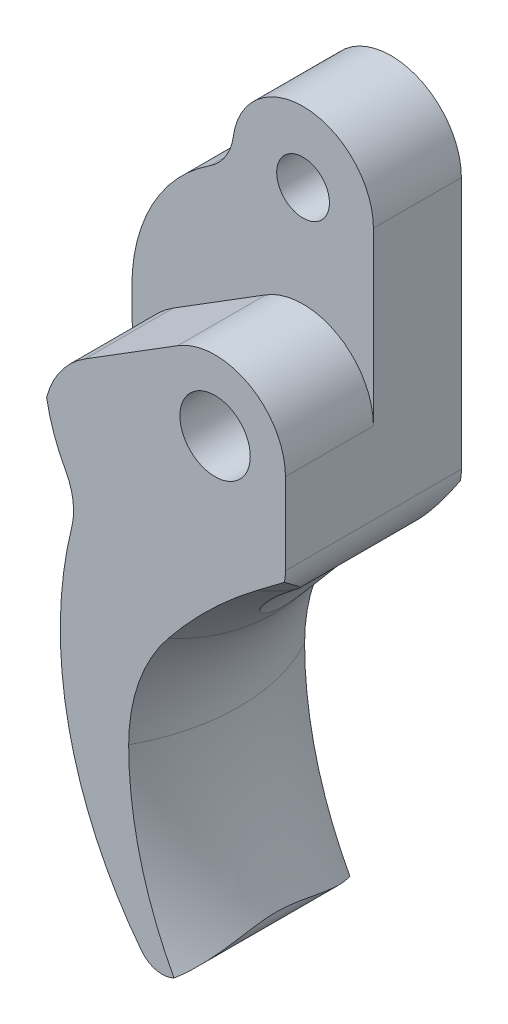
ISO-10303-21;
HEADER;
FILE_DESCRIPTION(('STEP AP214'),'2;1');
FILE_NAME('part.step','',(''),(''),'','','');
FILE_SCHEMA(('AUTOMOTIVE_DESIGN { 1 0 10303 214 1 1 1 1 }'));
ENDSEC;
DATA;
#1=APPLICATION_CONTEXT('core data for automotive mechanical design processes');
#2=APPLICATION_PROTOCOL_DEFINITION('international standard','automotive_design',2000,#1);
#3=PRODUCT_CONTEXT('',#1,'mechanical');
#4=PRODUCT('Part','Part','',(#3));
#5=PRODUCT_RELATED_PRODUCT_CATEGORY('part','',(#4));
#6=PRODUCT_DEFINITION_FORMATION('','',#4);
#7=PRODUCT_DEFINITION_CONTEXT('part definition',#1,'design');
#8=PRODUCT_DEFINITION('design','',#6,#7);
#9=PRODUCT_DEFINITION_SHAPE('','',#8);
#10=(LENGTH_UNIT() NAMED_UNIT(*) SI_UNIT(.MILLI.,.METRE.));
#11=(NAMED_UNIT(*) PLANE_ANGLE_UNIT() SI_UNIT($,.RADIAN.));
#12=(NAMED_UNIT(*) SI_UNIT($,.STERADIAN.) SOLID_ANGLE_UNIT());
#13=UNCERTAINTY_MEASURE_WITH_UNIT(LENGTH_MEASURE(1.E-05),#10,'distance_accuracy_value','');
#14=(GEOMETRIC_REPRESENTATION_CONTEXT(3) GLOBAL_UNCERTAINTY_ASSIGNED_CONTEXT((#13)) GLOBAL_UNIT_ASSIGNED_CONTEXT((#10,
#11,#12)) REPRESENTATION_CONTEXT('',''));
#15=CARTESIAN_POINT('',(0.,0.,0.));
#16=DIRECTION('',(0.,0.,1.));
#17=DIRECTION('',(1.,0.,0.));
#18=AXIS2_PLACEMENT_3D('',#15,#16,#17);
#19=CARTESIAN_POINT('',(37.0468900795997,16.1214230632718,10.));
#20=DIRECTION('',(0.,0.,-1.));
#21=DIRECTION('',(-1.,0.,0.));
#22=AXIS2_PLACEMENT_3D('',#19,#20,#21);
#23=CYLINDRICAL_SURFACE('',#22,1.5);
#24=CARTESIAN_POINT('',(37.0468900795997,16.1214230632718,0.));
#25=DIRECTION('',(0.,0.,1.));
#26=DIRECTION('',(1.,0.,0.));
#27=AXIS2_PLACEMENT_3D('',#24,#25,#26);
#28=CIRCLE('',#27,1.5);
#29=CARTESIAN_POINT('',(37.7113891036625,14.7766401636856,0.));
#30=VERTEX_POINT('',#29);
#31=CARTESIAN_POINT('',(35.8593769816345,15.2050101420617,0.));
#32=VERTEX_POINT('',#31);
#33=EDGE_CURVE('E288',#30,#32,#28,.F.);
#34=ORIENTED_EDGE('',*,*,#33,.F.);
#35=CARTESIAN_POINT('',(37.7112915680597,14.7765919727135,-0.000199999999999497));
#36=CARTESIAN_POINT('',(37.7536660796321,14.7975449268555,0.0866944281838508));
#37=CARTESIAN_POINT('',(37.7938881450415,14.8198894363823,0.174271305247938));
#38=CARTESIAN_POINT('',(37.870232348617,14.8667815741816,0.350563302515582));
#39=CARTESIAN_POINT('',(37.9063565368767,14.8913280897247,0.439277828627219));
#40=CARTESIAN_POINT('',(37.974677887401,14.9420114038807,0.617512596830948));
#41=CARTESIAN_POINT('',(38.0068834001479,14.9681446364688,0.707030673105937));
#42=CARTESIAN_POINT('',(38.067681275715,15.0215941470922,0.886943528837865));
#43=CARTESIAN_POINT('',(38.0962731347963,15.0489105893545,0.977338428635997));
#44=CARTESIAN_POINT('',(38.1774910137822,15.1325703397987,1.25151425201171));
#45=CARTESIAN_POINT('',(38.2248835280636,15.1900999507036,1.43649840473062));
#46=CARTESIAN_POINT('',(38.3074832707277,15.3053780990301,1.80914993243926));
#47=CARTESIAN_POINT('',(38.3426836528483,15.3631267411058,1.996818753568));
#48=CARTESIAN_POINT('',(38.4070775822015,15.4847792338819,2.40358988779562));
#49=CARTESIAN_POINT('',(38.4345192468538,15.5482669229304,2.62309466755423));
#50=CARTESIAN_POINT('',(38.4778654840021,15.6672193579066,3.06550163311419));
#51=CARTESIAN_POINT('',(38.4937644320608,15.7226801820476,3.28840542121775));
#52=CARTESIAN_POINT('',(38.5168472465537,15.8186720737926,3.73525842315989));
#53=CARTESIAN_POINT('',(38.5241319275385,15.859371901039,3.95916411979586));
#54=CARTESIAN_POINT('',(38.5311514432042,15.9041752813241,4.29709914363822));
#55=CARTESIAN_POINT('',(38.5328402047293,15.9163992543672,4.41001393368922));
#56=CARTESIAN_POINT('',(38.5352440428286,15.9346367144495,4.63635990998935));
#57=CARTESIAN_POINT('',(38.5359591972535,15.9406506980363,4.74979105422246));
#58=CARTESIAN_POINT('',(38.5366032576177,15.9460268231242,4.97809129981084));
#59=CARTESIAN_POINT('',(38.5365232516444,15.9453135723863,5.09296225513823));
#60=CARTESIAN_POINT('',(38.5355291362371,15.9371237149577,5.32245450143362));
#61=CARTESIAN_POINT('',(38.5346149818389,15.9296467436734,5.43707577860901));
#62=CARTESIAN_POINT('',(38.5302978023068,15.8978598759886,5.78033131507188));
#63=CARTESIAN_POINT('',(38.5253185340191,15.8641897089152,6.00808946499086));
#64=CARTESIAN_POINT('',(38.5079385898666,15.7790948795662,6.46268607386478));
#65=CARTESIAN_POINT('',(38.4954461790898,15.7274541373677,6.68947768001356));
#66=CARTESIAN_POINT('',(38.4596703918999,15.6138633254265,7.13953176823015));
#67=CARTESIAN_POINT('',(38.4363889314774,15.5519150874083,7.36279486963621));
#68=CARTESIAN_POINT('',(38.3779217213972,15.4265230078404,7.79394465277349));
#69=CARTESIAN_POINT('',(38.3434539320103,15.3633446925721,8.0020061867956));
#70=CARTESIAN_POINT('',(38.2602624265405,15.2362667394388,8.41493899348692));
#71=CARTESIAN_POINT('',(38.2115497240276,15.1723676953701,8.6198126025206));
#72=CARTESIAN_POINT('',(38.1265137207748,15.0792401393718,8.92297943427166));
#73=CARTESIAN_POINT('',(38.0964183710011,15.0488489459133,9.02267962832192));
#74=CARTESIAN_POINT('',(38.0319374988948,14.9893426320892,9.22105761941984));
#75=CARTESIAN_POINT('',(37.9975527254894,14.9602272901579,9.31973559169651));
#76=CARTESIAN_POINT('',(37.9241005852908,14.9037788287653,9.51619039133998));
#77=CARTESIAN_POINT('',(37.8850208227809,14.876450735013,9.61396406517536));
#78=CARTESIAN_POINT('',(37.8019285389153,14.8243859750154,9.80816623940301));
#79=CARTESIAN_POINT('',(37.7579129147288,14.7996509579714,9.90459385031087));
#80=CARTESIAN_POINT('',(37.7112915680597,14.7765919727135,10.0002));
#81=B_SPLINE_CURVE_WITH_KNOTS('',3,(#35,#36,#37,#38,#39,#40,#41,#42,#43,#44,#45,#46,#47,#48,#49,
#50,#51,#52,#53,#54,#55,#56,#57,#58,#59,#60,#61,#62,#63,#64,#65,#66,#67,#68,#69,#70,#71,#72,#73,
#74,#75,#76,#77,#78,#79,#80),.UNSPECIFIED.,.F.,.F.,(4,2,2,2,2,2,2,2,2,2,2,2,2,2,2,2,2,2,2,2,2,2,
4),(0.,0.29668562632712,0.593222165457578,0.889115303579091,1.18504964345908,1.78284891382982,
2.38098332496234,3.07094677921029,3.76124620777969,4.4433843463613,4.78399759100309,
5.12458359827429,5.46899105482292,5.81341707751812,6.50306778889993,7.20131506504774,
7.89943838933107,8.55951279604266,9.21907820412387,9.54446102473464,9.86978711328128,
10.1959918267588,10.522402764171),.UNSPECIFIED.);
#82=CARTESIAN_POINT('',(37.7113891036625,14.7766401636856,10.));
#83=VERTEX_POINT('',#82);
#84=EDGE_CURVE('E178',#30,#83,#81,.T.);
#85=ORIENTED_EDGE('',*,*,#84,.T.);
#86=CARTESIAN_POINT('',(37.0468900795997,16.1214230632718,10.));
#87=DIRECTION('',(0.,0.,1.));
#88=DIRECTION('',(1.,0.,0.));
#89=AXIS2_PLACEMENT_3D('',#86,#87,#88);
#90=CIRCLE('',#89,1.5);
#91=CARTESIAN_POINT('',(35.8593769816345,15.2050101420617,10.));
#92=VERTEX_POINT('',#91);
#93=EDGE_CURVE('E287',#83,#92,#90,.F.);
#94=ORIENTED_EDGE('',*,*,#93,.T.);
#95=DIRECTION('',(0.,0.,-1.));
#96=VECTOR('',#95,1.);
#97=CARTESIAN_POINT('',(35.8593769816345,15.2050101420617,10.));
#98=LINE('',#97,#96);
#99=EDGE_CURVE('E284',#92,#32,#98,.T.);
#100=ORIENTED_EDGE('',*,*,#99,.T.);
#101=EDGE_LOOP('',(#34,#85,#94,#100));
#102=FACE_BOUND('',#101,.T.);
#103=ADVANCED_FACE('F36',(#102),#23,.T.);
#104=CARTESIAN_POINT('',(44.0468900795998,52.3520772627957,10.));
#105=DIRECTION('',(-1.,0.,0.));
#106=DIRECTION('',(0.,0.,1.));
#107=AXIS2_PLACEMENT_3D('',#104,#105,#106);
#108=PLANE('',#107);
#109=DIRECTION('',(0.,1.,0.));
#110=VECTOR('',#109,1.);
#111=CARTESIAN_POINT('',(44.0468900795998,52.3520772627957,10.));
#112=LINE('',#111,#110);
#113=CARTESIAN_POINT('',(44.0468900795998,37.9918684263362,10.));
#114=VERTEX_POINT('',#113);
#115=CARTESIAN_POINT('',(44.0468900795998,42.6214230632718,10.));
#116=VERTEX_POINT('',#115);
#117=EDGE_CURVE('E325',#114,#116,#112,.T.);
#118=ORIENTED_EDGE('',*,*,#117,.F.);
#119=DIRECTION('',(0.,0.,1.));
#120=VECTOR('',#119,1.);
#121=CARTESIAN_POINT('',(44.0468900795998,37.9918684263362,0.));
#122=LINE('',#121,#120);
#123=CARTESIAN_POINT('',(44.0468900795998,37.9918684263362,0.));
#124=VERTEX_POINT('',#123);
#125=EDGE_CURVE('E253',#114,#124,#122,.F.);
#126=ORIENTED_EDGE('',*,*,#125,.T.);
#127=DIRECTION('',(0.,1.,0.));
#128=VECTOR('',#127,1.);
#129=CARTESIAN_POINT('',(44.0468900795998,52.3520772627957,0.));
#130=LINE('',#129,#128);
#131=CARTESIAN_POINT('',(44.0468900795998,52.3520772627957,0.));
#132=VERTEX_POINT('',#131);
#133=EDGE_CURVE('E326',#124,#132,#130,.T.);
#134=ORIENTED_EDGE('',*,*,#133,.T.);
#135=DIRECTION('',(0.,0.,1.));
#136=VECTOR('',#135,1.);
#137=CARTESIAN_POINT('',(44.0468900795998,52.3520772627957,0.));
#138=LINE('',#137,#136);
#139=CARTESIAN_POINT('',(44.0468900795998,52.3520772627957,5.));
#140=VERTEX_POINT('',#139);
#141=EDGE_CURVE('E328',#132,#140,#138,.T.);
#142=ORIENTED_EDGE('',*,*,#141,.T.);
#143=DIRECTION('',(0.,-1.,0.));
#144=VECTOR('',#143,1.);
#145=CARTESIAN_POINT('',(44.0468900795998,-12.4832278226516,5.));
#146=LINE('',#145,#144);
#147=CARTESIAN_POINT('',(44.0468900795998,42.6214230632718,5.));
#148=VERTEX_POINT('',#147);
#149=EDGE_CURVE('E323',#140,#148,#146,.T.);
#150=ORIENTED_EDGE('',*,*,#149,.T.);
#151=DIRECTION('',(0.,0.,1.));
#152=VECTOR('',#151,1.);
#153=CARTESIAN_POINT('',(44.0468900795998,42.6214230632718,5.));
#154=LINE('',#153,#152);
#155=EDGE_CURVE('E332',#148,#116,#154,.T.);
#156=ORIENTED_EDGE('',*,*,#155,.T.);
#157=EDGE_LOOP('',(#118,#126,#134,#142,#150,#156));
#158=FACE_BOUND('',#157,.T.);
#159=ADVANCED_FACE('F384',(#158),#108,.F.);
#160=CARTESIAN_POINT('',(40.0468900795998,52.3520772627957,10.));
#161=DIRECTION('',(0.,0.,-1.));
#162=DIRECTION('',(-1.,0.,0.));
#163=AXIS2_PLACEMENT_3D('',#160,#161,#162);
#164=CYLINDRICAL_SURFACE('',#163,4.);
#165=CARTESIAN_POINT('',(40.0468900795998,52.3520772627957,0.));
#166=DIRECTION('',(0.,0.,1.));
#167=DIRECTION('',(1.,0.,0.));
#168=AXIS2_PLACEMENT_3D('',#165,#166,#167);
#169=CIRCLE('',#168,4.);
#170=CARTESIAN_POINT('',(36.0834796424937,52.8918713967383,0.));
#171=VERTEX_POINT('',#170);
#172=EDGE_CURVE('E302',#132,#171,#169,.T.);
#173=ORIENTED_EDGE('',*,*,#172,.T.);
#174=DIRECTION('',(0.,0.,-1.));
#175=VECTOR('',#174,1.);
#176=CARTESIAN_POINT('',(36.0834796424937,52.8918713967383,10.));
#177=LINE('',#176,#175);
#178=CARTESIAN_POINT('',(36.0834796424937,52.8918713967383,5.));
#179=VERTEX_POINT('',#178);
#180=EDGE_CURVE('E276',#171,#179,#177,.F.);
#181=ORIENTED_EDGE('',*,*,#180,.T.);
#182=CARTESIAN_POINT('',(40.0468900795998,52.3520772627957,5.));
#183=DIRECTION('',(0.,0.,1.));
#184=DIRECTION('',(1.,0.,0.));
#185=AXIS2_PLACEMENT_3D('',#182,#183,#184);
#186=CIRCLE('',#185,4.);
#187=EDGE_CURVE('E320',#140,#179,#186,.T.);
#188=ORIENTED_EDGE('',*,*,#187,.F.);
#189=ORIENTED_EDGE('',*,*,#141,.F.);
#190=EDGE_LOOP('',(#173,#181,#188,#189));
#191=FACE_BOUND('',#190,.T.);
#192=ADVANCED_FACE('F389',(#191),#164,.T.);
#193=CARTESIAN_POINT('',(40.0468900795998,42.6214230632718,10.));
#194=DIRECTION('',(0.,0.,-1.));
#195=DIRECTION('',(-1.,0.,0.));
#196=AXIS2_PLACEMENT_3D('',#193,#194,#195);
#197=CYLINDRICAL_SURFACE('',#196,9.73065419952389);
#198=CARTESIAN_POINT('',(40.0468900795998,42.6214230632718,5.));
#199=DIRECTION('',(0.,0.,1.));
#200=DIRECTION('',(1.,0.,0.));
#201=AXIS2_PLACEMENT_3D('',#198,#199,#200);
#202=CIRCLE('',#201,9.73065419952389);
#203=CARTESIAN_POINT('',(34.7453943616905,50.7810660887786,5.));
#204=VERTEX_POINT('',#203);
#205=CARTESIAN_POINT('',(30.3162358800759,42.6214230632718,5.));
#206=VERTEX_POINT('',#205);
#207=EDGE_CURVE('E308',#204,#206,#202,.T.);
#208=ORIENTED_EDGE('',*,*,#207,.F.);
#209=DIRECTION('',(0.,0.,-1.));
#210=VECTOR('',#209,1.);
#211=CARTESIAN_POINT('',(34.7453943616905,50.7810660887786,10.));
#212=LINE('',#211,#210);
#213=CARTESIAN_POINT('',(34.7453943616905,50.7810660887786,0.));
#214=VERTEX_POINT('',#213);
#215=EDGE_CURVE('E271',#204,#214,#212,.T.);
#216=ORIENTED_EDGE('',*,*,#215,.T.);
#217=CARTESIAN_POINT('',(40.0468900795998,42.6214230632718,0.));
#218=DIRECTION('',(0.,0.,1.));
#219=DIRECTION('',(1.,0.,0.));
#220=AXIS2_PLACEMENT_3D('',#217,#218,#219);
#221=CIRCLE('',#220,9.73065419952389);
#222=CARTESIAN_POINT('',(30.3162358800759,42.6214230632718,0.));
#223=VERTEX_POINT('',#222);
#224=EDGE_CURVE('E299',#214,#223,#221,.T.);
#225=ORIENTED_EDGE('',*,*,#224,.T.);
#226=DIRECTION('',(0.,0.,-1.));
#227=VECTOR('',#226,1.);
#228=CARTESIAN_POINT('',(30.3162358800759,42.6214230632718,10.));
#229=LINE('',#228,#227);
#230=EDGE_CURVE('E272',#206,#223,#229,.T.);
#231=ORIENTED_EDGE('',*,*,#230,.F.);
#232=EDGE_LOOP('',(#208,#216,#225,#231));
#233=FACE_BOUND('',#232,.T.);
#234=ADVANCED_FACE('F405',(#233),#197,.T.);
#235=CARTESIAN_POINT('',(30.3162358800759,0.,10.));
#236=DIRECTION('',(-1.,0.,0.));
#237=DIRECTION('',(0.,0.,1.));
#238=AXIS2_PLACEMENT_3D('',#235,#236,#237);
#239=PLANE('',#238);
#240=DIRECTION('',(0.,1.,0.));
#241=VECTOR('',#240,1.);
#242=CARTESIAN_POINT('',(30.3162358800759,0.,0.));
#243=LINE('',#242,#241);
#244=CARTESIAN_POINT('',(30.3162358800759,41.485061410367,0.));
#245=VERTEX_POINT('',#244);
#246=EDGE_CURVE('E297',#245,#223,#243,.T.);
#247=ORIENTED_EDGE('',*,*,#246,.F.);
#248=DIRECTION('',(0.,0.,-1.));
#249=VECTOR('',#248,1.);
#250=CARTESIAN_POINT('',(30.3162358800759,41.485061410367,10.));
#251=LINE('',#250,#249);
#252=CARTESIAN_POINT('',(30.3162358800759,41.485061410367,5.));
#253=VERTEX_POINT('',#252);
#254=EDGE_CURVE('E261',#245,#253,#251,.F.);
#255=ORIENTED_EDGE('',*,*,#254,.T.);
#256=DIRECTION('',(0.,1.,0.));
#257=VECTOR('',#256,1.);
#258=CARTESIAN_POINT('',(30.3162358800759,0.,5.));
#259=LINE('',#258,#257);
#260=EDGE_CURVE('E269',#253,#206,#259,.T.);
#261=ORIENTED_EDGE('',*,*,#260,.T.);
#262=ORIENTED_EDGE('',*,*,#230,.T.);
#263=EDGE_LOOP('',(#247,#255,#261,#262));
#264=FACE_BOUND('',#263,.T.);
#265=ADVANCED_FACE('F401',(#264),#239,.T.);
#266=CARTESIAN_POINT('',(28.4089876840903,34.9229552352527,10.));
#267=DIRECTION('',(0.,0.,-1.));
#268=DIRECTION('',(-1.,0.,0.));
#269=AXIS2_PLACEMENT_3D('',#266,#267,#268);
#270=CYLINDRICAL_SURFACE('',#269,3.59572716165903);
#271=CARTESIAN_POINT('',(28.4089876840903,34.9229552352527,10.));
#272=DIRECTION('',(0.,0.,1.));
#273=DIRECTION('',(1.,0.,0.));
#274=AXIS2_PLACEMENT_3D('',#271,#272,#273);
#275=CIRCLE('',#274,3.59572716165903);
#276=CARTESIAN_POINT('',(31.8989691004052,34.0573435816405,10.));
#277=VERTEX_POINT('',#276);
#278=CARTESIAN_POINT('',(31.5581547164844,36.6584669244024,10.));
#279=VERTEX_POINT('',#278);
#280=EDGE_CURVE('E313',#277,#279,#275,.T.);
#281=ORIENTED_EDGE('',*,*,#280,.T.);
#282=DIRECTION('',(0.,0.,-1.));
#283=VECTOR('',#282,1.);
#284=CARTESIAN_POINT('',(31.5581547164844,36.6584669244024,10.));
#285=LINE('',#284,#283);
#286=CARTESIAN_POINT('',(31.5581547164844,36.6584669244024,0.));
#287=VERTEX_POINT('',#286);
#288=EDGE_CURVE('E265',#279,#287,#285,.T.);
#289=ORIENTED_EDGE('',*,*,#288,.T.);
#290=CARTESIAN_POINT('',(28.4089876840903,34.9229552352527,0.));
#291=DIRECTION('',(0.,0.,1.));
#292=DIRECTION('',(1.,0.,0.));
#293=AXIS2_PLACEMENT_3D('',#290,#291,#292);
#294=CIRCLE('',#293,3.59572716165903);
#295=CARTESIAN_POINT('',(31.8989691004052,34.0573435816405,0.));
#296=VERTEX_POINT('',#295);
#297=EDGE_CURVE('E294',#296,#287,#294,.T.);
#298=ORIENTED_EDGE('',*,*,#297,.F.);
#299=DIRECTION('',(0.,0.,-1.));
#300=VECTOR('',#299,1.);
#301=CARTESIAN_POINT('',(31.8989691004052,34.0573435816405,10.));
#302=LINE('',#301,#300);
#303=EDGE_CURVE('E282',#277,#296,#302,.T.);
#304=ORIENTED_EDGE('',*,*,#303,.F.);
#305=EDGE_LOOP('',(#281,#289,#298,#304));
#306=FACE_BOUND('',#305,.T.);
#307=ADVANCED_FACE('F397',(#306),#270,.F.);
#308=CARTESIAN_POINT('',(53.3835761925783,28.7285684238916,10.));
#309=DIRECTION('',(0.,0.,-1.));
#310=DIRECTION('',(-1.,0.,0.));
#311=AXIS2_PLACEMENT_3D('',#308,#309,#310);
#312=CYLINDRICAL_SURFACE('',#311,22.135586429704);
#313=CARTESIAN_POINT('',(53.3835761925783,28.7285684238916,0.));
#314=DIRECTION('',(0.,0.,1.));
#315=DIRECTION('',(1.,0.,0.));
#316=AXIS2_PLACEMENT_3D('',#313,#314,#315);
#317=CIRCLE('',#316,22.135586429704);
#318=EDGE_CURVE('E291',#32,#296,#317,.F.);
#319=ORIENTED_EDGE('',*,*,#318,.F.);
#320=ORIENTED_EDGE('',*,*,#99,.F.);
#321=CARTESIAN_POINT('',(53.3835761925783,28.7285684238916,10.));
#322=DIRECTION('',(0.,0.,1.));
#323=DIRECTION('',(1.,0.,0.));
#324=AXIS2_PLACEMENT_3D('',#321,#322,#323);
#325=CIRCLE('',#324,22.135586429704);
#326=EDGE_CURVE('E310',#92,#277,#325,.F.);
#327=ORIENTED_EDGE('',*,*,#326,.T.);
#328=ORIENTED_EDGE('',*,*,#303,.T.);
#329=EDGE_LOOP('',(#319,#320,#327,#328));
#330=FACE_BOUND('',#329,.T.);
#331=ADVANCED_FACE('F394',(#330),#312,.T.);
#332=CARTESIAN_POINT('',(52.003768227748,23.4918388035914,10.));
#333=DIRECTION('',(0.,0.,-1.));
#334=DIRECTION('',(-1.,0.,0.));
#335=AXIS2_PLACEMENT_3D('',#332,#333,#334);
#336=CYLINDRICAL_SURFACE('',#335,15.1742685633795);
#337=CARTESIAN_POINT('',(42.8557259721428,35.5985208149118,1.73806845655022));
#338=CARTESIAN_POINT('',(42.7112234047761,35.4893488474901,1.73809308104275));
#339=CARTESIAN_POINT('',(42.5686847337989,35.3775636678459,1.74256255177231));
#340=CARTESIAN_POINT('',(42.2879859020588,35.1492242694375,1.76059879453041));
#341=CARTESIAN_POINT('',(42.1498274004668,35.0326682809437,1.7741689717115));
#342=CARTESIAN_POINT('',(41.8769094187302,34.7939810330239,1.81082123010287));
#343=CARTESIAN_POINT('',(41.742206271165,34.6718015291446,1.83400946096826));
#344=CARTESIAN_POINT('',(41.4783819356944,34.4237843685225,1.89033632346708));
#345=CARTESIAN_POINT('',(41.3492600546076,34.2979471693231,1.92347371535061));
#346=CARTESIAN_POINT('',(41.0968278353353,34.0431095289768,2.00041994685906));
#347=CARTESIAN_POINT('',(40.9735315186647,33.9141024893883,2.04425310938596));
#348=CARTESIAN_POINT('',(40.7336845446002,33.654263994326,2.14342887844515));
#349=CARTESIAN_POINT('',(40.6171327111431,33.523432861894,2.19876947060203));
#350=CARTESIAN_POINT('',(40.3919394218165,33.2618695570882,2.32188132413713));
#351=CARTESIAN_POINT('',(40.2832659530487,33.1311394011022,2.38959782380427));
#352=CARTESIAN_POINT('',(40.0742291684814,32.8711935397889,2.53908928983339));
#353=CARTESIAN_POINT('',(39.9738591592051,32.741976688157,2.6208527659599));
#354=CARTESIAN_POINT('',(39.783571958143,32.4890596378848,2.79940655128909));
#355=CARTESIAN_POINT('',(39.6935513489775,32.3653142033026,2.89602048450036));
#356=CARTESIAN_POINT('',(39.5243293321924,32.1256953635828,3.10720024742351));
#357=CARTESIAN_POINT('',(39.4451262291582,32.009820726299,3.2217632579414));
#358=CARTESIAN_POINT('',(39.311315770446,31.8088303236683,3.45174941177933));
#359=CARTESIAN_POINT('',(39.2547989391907,31.7217298641337,3.56429362719118));
#360=CARTESIAN_POINT('',(39.1535983317042,31.5627998318642,3.80455533105248));
#361=CARTESIAN_POINT('',(39.1088919402647,31.4909411262762,3.93224313208591));
#362=CARTESIAN_POINT('',(39.0439078755082,31.3850810967765,4.16664792132142));
#363=CARTESIAN_POINT('',(39.020300500732,31.3460943472708,4.27017054895262));
#364=CARTESIAN_POINT('',(38.9823936589453,31.2830900568274,4.48332097524781));
#365=CARTESIAN_POINT('',(38.9680852486444,31.2590581340147,4.59294279749304));
#366=CARTESIAN_POINT('',(38.94970244764,31.2281260335179,4.81611561986046));
#367=CARTESIAN_POINT('',(38.9456860536378,31.2213229448088,4.9296852472989));
#368=CARTESIAN_POINT('',(38.9483827988561,31.2258767540914,5.1563340753454));
#369=CARTESIAN_POINT('',(38.9550965454256,31.2372346800355,5.26941324782939));
#370=CARTESIAN_POINT('',(38.977782336095,31.2753175271553,5.48261552053062));
#371=CARTESIAN_POINT('',(38.9929844860369,31.3007632450686,5.58305803488317));
#372=CARTESIAN_POINT('',(39.0311603034751,31.3640196568109,5.77836529558282));
#373=CARTESIAN_POINT('',(39.0541372061801,31.4018354978431,5.87322770062947));
#374=CARTESIAN_POINT('',(39.1195141737094,31.5080669252736,6.10012904516728));
#375=CARTESIAN_POINT('',(39.1659454727626,31.5824619448872,6.22819744400151));
#376=CARTESIAN_POINT('',(39.2707045219452,31.7463516771512,6.46891540529763));
#377=CARTESIAN_POINT('',(39.3290618469951,31.8358838306152,6.58152544951461));
#378=CARTESIAN_POINT('',(39.4413626680346,32.0037273540222,6.76869287620869));
#379=CARTESIAN_POINT('',(39.4934195318253,32.0801299480409,6.84615338408745));
#380=CARTESIAN_POINT('',(39.6026342281991,32.23709131429,6.99290008165875));
#381=CARTESIAN_POINT('',(39.6597949167547,32.3176524027378,7.06218164362974));
#382=CARTESIAN_POINT('',(39.7786931928756,32.4816242442785,7.19329987969674));
#383=CARTESIAN_POINT('',(39.8404374049092,32.565039024113,7.25512542549219));
#384=CARTESIAN_POINT('',(39.9680008806664,32.7335874912276,7.37187154677194));
#385=CARTESIAN_POINT('',(40.0338215151567,32.8187217501556,7.42678978053283));
#386=CARTESIAN_POINT('',(40.2099042545179,33.0413768836674,7.56141799420129));
#387=CARTESIAN_POINT('',(40.3230826913958,33.1796048724082,7.63616929218451));
#388=CARTESIAN_POINT('',(40.5578907774432,33.4559375379563,7.77132327145254));
#389=CARTESIAN_POINT('',(40.6795255515937,33.594042087692,7.83171715167327));
#390=CARTESIAN_POINT('',(40.9304953977729,33.8685272107485,7.93961762643238));
#391=CARTESIAN_POINT('',(41.0598381318296,34.0049058996062,7.98711112783514));
#392=CARTESIAN_POINT('',(41.3254101958363,34.2745544327003,8.07020436326497));
#393=CARTESIAN_POINT('',(41.461641289479,34.4078234678462,8.10580103329697));
#394=CARTESIAN_POINT('',(41.7993209770769,34.7257941965541,8.178572672579));
#395=CARTESIAN_POINT('',(42.0039950465123,34.9084235717652,8.21005406878346));
#396=CARTESIAN_POINT('',(42.3184475242322,35.1739502760085,8.24129430126172));
#397=CARTESIAN_POINT('',(42.4241935954276,35.2608207229228,8.2490444984349));
#398=CARTESIAN_POINT('',(42.6381543070746,35.4317905681166,8.2593605873004));
#399=CARTESIAN_POINT('',(42.7463690014788,35.5158899057342,8.26192636557568));
#400=CARTESIAN_POINT('',(42.8557259721427,35.5985208149118,8.26193154345011));
#401=B_SPLINE_CURVE_WITH_KNOTS('',3,(#337,#338,#339,#340,#341,#342,#343,#344,#345,#346,#347,
#348,#349,#350,#351,#352,#353,#354,#355,#356,#357,#358,#359,#360,#361,#362,#363,#364,#365,#366,
#367,#368,#369,#370,#371,#372,#373,#374,#375,#376,#377,#378,#379,#380,#381,#382,#383,#384,#385,
#386,#387,#388,#389,#390,#391,#392,#393,#394,#395,#396,#397,#398,#399,#400),.UNSPECIFIED.,.F.,
.F.,(4,2,2,2,2,2,2,2,2,2,2,2,2,2,2,2,2,2,2,2,2,2,2,2,2,2,2,2,2,2,2,4),(0.,0.543248135260589,
1.08669964765629,1.63631565550832,2.18586320494515,2.73667230374477,3.28738506446589,
3.83571753312247,4.3836035904611,4.92542424807373,5.46715988911366,5.92502737716225,
6.38201165670154,6.72002849786121,7.05771976793027,7.39730982415709,7.73691910259116,
8.04981155870031,8.36283437519802,8.82586955740775,9.29006724972197,9.65142017704565,
10.0129765910245,10.3750661286745,10.7372780932572,11.3173726352902,11.8978218622735,
12.4788580287208,13.0600437242693,13.8869062900136,14.2980024846022,14.7091076724464),.UNSPECIFIED.);
#402=CARTESIAN_POINT('',(42.8555259721428,35.5983696884621,1.73806845367584));
#403=VERTEX_POINT('',#402);
#404=CARTESIAN_POINT('',(42.8555259721428,35.5983696884621,8.26193154632414));
#405=VERTEX_POINT('',#404);
#406=EDGE_CURVE('E214',#403,#405,#401,.T.);
#407=ORIENTED_EDGE('',*,*,#406,.F.);
#408=DIRECTION('',(0.,0.,-1.));
#409=VECTOR('',#408,1.);
#410=CARTESIAN_POINT('',(42.8555259721428,35.5983696884621,10.));
#411=LINE('',#410,#409);
#412=EDGE_CURVE('E249',#403,#405,#411,.F.);
#413=ORIENTED_EDGE('',*,*,#412,.T.);
#414=EDGE_LOOP('',(#407,#413));
#415=FACE_BOUND('',#414,.T.);
#416=ADVANCED_FACE('F227',(#415),#336,.F.);
#417=CARTESIAN_POINT('',(40.0468900795998,42.6214230632718,10.));
#418=DIRECTION('',(0.,0.,-1.));
#419=DIRECTION('',(-1.,0.,0.));
#420=AXIS2_PLACEMENT_3D('',#417,#418,#419);
#421=CYLINDRICAL_SURFACE('',#420,2.);
#422=CARTESIAN_POINT('',(40.0468900795998,42.6214230632718,10.));
#423=DIRECTION('',(0.,0.,1.));
#424=DIRECTION('',(1.,0.,0.));
#425=AXIS2_PLACEMENT_3D('',#422,#423,#424);
#426=CIRCLE('',#425,2.);
#427=CARTESIAN_POINT('',(42.0468900795998,42.6214230632718,10.));
#428=VERTEX_POINT('',#427);
#429=EDGE_CURVE('E290',#428,#428,#426,.T.);
#430=ORIENTED_EDGE('',*,*,#429,.T.);
#431=EDGE_LOOP('',(#430));
#432=FACE_BOUND('',#431,.T.);
#433=CARTESIAN_POINT('',(40.0468900795998,42.6214230632718,0.));
#434=DIRECTION('',(0.,0.,1.));
#435=DIRECTION('',(1.,0.,0.));
#436=AXIS2_PLACEMENT_3D('',#433,#434,#435);
#437=CIRCLE('',#436,2.);
#438=CARTESIAN_POINT('',(42.0468900795998,42.6214230632718,0.));
#439=VERTEX_POINT('',#438);
#440=EDGE_CURVE('E305',#439,#439,#437,.T.);
#441=ORIENTED_EDGE('',*,*,#440,.F.);
#442=EDGE_LOOP('',(#441));
#443=FACE_BOUND('',#442,.T.);
#444=ADVANCED_FACE('F380',(#432,#443),#421,.F.);
#445=CARTESIAN_POINT('',(0.,0.,10.));
#446=DIRECTION('',(0.,0.,1.));
#447=DIRECTION('',(1.,0.,0.));
#448=AXIS2_PLACEMENT_3D('',#445,#446,#447);
#449=PLANE('',#448);
#450=DIRECTION('',(0.797832912624713,0.602878630847675,0.));
#451=VECTOR('',#450,1.);
#452=CARTESIAN_POINT('',(42.403366999007,36.1967443729306,10.));
#453=LINE('',#452,#451);
#454=CARTESIAN_POINT('',(42.403366999007,36.1967443729306,10.));
#455=VERTEX_POINT('',#454);
#456=CARTESIAN_POINT('',(43.9865176049475,37.3930445689142,10.));
#457=VERTEX_POINT('',#456);
#458=EDGE_CURVE('E210',#455,#457,#453,.T.);
#459=ORIENTED_EDGE('',*,*,#458,.T.);
#460=CARTESIAN_POINT('',(41.0468900795998,37.9918684263362,10.));
#461=DIRECTION('',(0.,0.,1.));
#462=DIRECTION('',(1.,0.,0.));
#463=AXIS2_PLACEMENT_3D('',#460,#461,#462);
#464=CIRCLE('',#463,3.);
#465=EDGE_CURVE('E247',#457,#114,#464,.T.);
#466=ORIENTED_EDGE('',*,*,#465,.T.);
#467=ORIENTED_EDGE('',*,*,#117,.T.);
#468=CARTESIAN_POINT('',(40.0468900795998,42.6214230632718,10.));
#469=DIRECTION('',(0.,0.,-1.));
#470=DIRECTION('',(1.,0.,0.));
#471=AXIS2_PLACEMENT_3D('',#468,#469,#470);
#472=CIRCLE('',#471,4.00000000000001);
#473=CARTESIAN_POINT('',(37.9304682258048,46.0156473541488,10.));
#474=VERTEX_POINT('',#473);
#475=EDGE_CURVE('E336',#474,#116,#472,.T.);
#476=ORIENTED_EDGE('',*,*,#475,.F.);
#477=DIRECTION('',(-0.848556072719232,-0.529105463448747,0.));
#478=VECTOR('',#477,1.);
#479=CARTESIAN_POINT('',(-10.0411724957329,16.1035908473488,10.));
#480=LINE('',#479,#478);
#481=CARTESIAN_POINT('',(32.6704615110853,42.7358425421738,10.));
#482=VERTEX_POINT('',#481);
#483=EDGE_CURVE('E348',#474,#482,#480,.T.);
#484=ORIENTED_EDGE('',*,*,#483,.T.);
#485=CARTESIAN_POINT('',(35.3159888283291,38.4930621785776,10.));
#486=DIRECTION('',(0.,0.,1.));
#487=DIRECTION('',(1.,0.,0.));
#488=AXIS2_PLACEMENT_3D('',#485,#486,#487);
#489=CIRCLE('',#488,5.);
#490=CARTESIAN_POINT('',(30.4714333062485,39.7301077692808,10.));
#491=VERTEX_POINT('',#490);
#492=EDGE_CURVE('E352',#491,#482,#489,.F.);
#493=ORIENTED_EDGE('',*,*,#492,.F.);
#494=CARTESIAN_POINT('',(40.3162358800759,41.485061410367,10.));
#495=DIRECTION('',(0.,0.,1.));
#496=DIRECTION('',(1.,0.,0.));
#497=AXIS2_PLACEMENT_3D('',#494,#495,#496);
#498=CIRCLE('',#497,10.);
#499=EDGE_CURVE('E255',#491,#279,#498,.T.);
#500=ORIENTED_EDGE('',*,*,#499,.T.);
#501=ORIENTED_EDGE('',*,*,#280,.F.);
#502=ORIENTED_EDGE('',*,*,#326,.F.);
#503=ORIENTED_EDGE('',*,*,#93,.F.);
#504=CARTESIAN_POINT('',(56.5827858555309,24.9688782113421,10.));
#505=DIRECTION('',(0.,0.,1.));
#506=DIRECTION('',(1.,0.,0.));
#507=AXIS2_PLACEMENT_3D('',#504,#505,#506);
#508=CIRCLE('',#507,21.4478747615358);
#509=CARTESIAN_POINT('',(35.1349110939951,24.9688782113421,10.));
#510=VERTEX_POINT('',#509);
#511=EDGE_CURVE('E183',#510,#83,#508,.T.);
#512=ORIENTED_EDGE('',*,*,#511,.F.);
#513=CARTESIAN_POINT('',(45.2654344766305,24.9688782113421,10.));
#514=DIRECTION('',(0.,0.,-1.));
#515=DIRECTION('',(-1.,0.,0.));
#516=AXIS2_PLACEMENT_3D('',#513,#514,#515);
#517=CIRCLE('',#516,10.1305233826354);
#518=CARTESIAN_POINT('',(37.378027436018,31.3262608631745,10.));
#519=VERTEX_POINT('',#518);
#520=EDGE_CURVE('E192',#510,#519,#517,.T.);
#521=ORIENTED_EDGE('',*,*,#520,.T.);
#522=CARTESIAN_POINT('',(59.6468115806748,13.377246533156,10.));
#523=DIRECTION('',(0.,0.,-1.));
#524=DIRECTION('',(-1.,0.,0.));
#525=AXIS2_PLACEMENT_3D('',#522,#523,#524);
#526=CIRCLE('',#525,28.6018506866344);
#527=EDGE_CURVE('E206',#519,#455,#526,.T.);
#528=ORIENTED_EDGE('',*,*,#527,.T.);
#529=EDGE_LOOP('',(#459,#466,#467,#476,#484,#493,#500,#501,#502,#503,#512,#521,#528));
#530=FACE_BOUND('',#529,.T.);
#531=ORIENTED_EDGE('',*,*,#429,.F.);
#532=EDGE_LOOP('',(#531));
#533=FACE_BOUND('',#532,.T.);
#534=ADVANCED_FACE('F372',(#530,#533),#449,.T.);
#535=CARTESIAN_POINT('',(0.,0.,0.));
#536=DIRECTION('',(0.,0.,1.));
#537=DIRECTION('',(1.,0.,0.));
#538=AXIS2_PLACEMENT_3D('',#535,#536,#537);
#539=PLANE('',#538);
#540=CARTESIAN_POINT('',(41.0468900795998,37.9918684263362,0.));
#541=DIRECTION('',(0.,0.,1.));
#542=DIRECTION('',(1.,0.,0.));
#543=AXIS2_PLACEMENT_3D('',#540,#541,#542);
#544=CIRCLE('',#543,3.);
#545=CARTESIAN_POINT('',(43.9865176049475,37.3930445689141,0.));
#546=VERTEX_POINT('',#545);
#547=EDGE_CURVE('E63',#124,#546,#544,.F.);
#548=ORIENTED_EDGE('',*,*,#547,.T.);
#549=DIRECTION('',(0.797832912624713,0.602878630847675,0.));
#550=VECTOR('',#549,1.);
#551=CARTESIAN_POINT('',(42.403366999007,36.1967443729306,0.));
#552=LINE('',#551,#550);
#553=CARTESIAN_POINT('',(42.403366999007,36.1967443729306,0.));
#554=VERTEX_POINT('',#553);
#555=EDGE_CURVE('E56',#554,#546,#552,.T.);
#556=ORIENTED_EDGE('',*,*,#555,.F.);
#557=CARTESIAN_POINT('',(59.6468115806748,13.377246533156,0.));
#558=DIRECTION('',(0.,0.,-1.));
#559=DIRECTION('',(-1.,0.,0.));
#560=AXIS2_PLACEMENT_3D('',#557,#558,#559);
#561=CIRCLE('',#560,28.6018506866344);
#562=CARTESIAN_POINT('',(37.378027436018,31.3262608631745,0.));
#563=VERTEX_POINT('',#562);
#564=EDGE_CURVE('E197',#563,#554,#561,.T.);
#565=ORIENTED_EDGE('',*,*,#564,.F.);
#566=CARTESIAN_POINT('',(45.2654344766305,24.9688782113421,0.));
#567=DIRECTION('',(0.,0.,-1.));
#568=DIRECTION('',(-1.,0.,0.));
#569=AXIS2_PLACEMENT_3D('',#566,#567,#568);
#570=CIRCLE('',#569,10.1305233826354);
#571=CARTESIAN_POINT('',(35.1349110939951,24.9688782113421,0.));
#572=VERTEX_POINT('',#571);
#573=EDGE_CURVE('E189',#572,#563,#570,.T.);
#574=ORIENTED_EDGE('',*,*,#573,.F.);
#575=CARTESIAN_POINT('',(56.5827858555309,24.9688782113421,0.));
#576=DIRECTION('',(0.,0.,1.));
#577=DIRECTION('',(1.,0.,0.));
#578=AXIS2_PLACEMENT_3D('',#575,#576,#577);
#579=CIRCLE('',#578,21.4478747615358);
#580=EDGE_CURVE('E172',#572,#30,#579,.T.);
#581=ORIENTED_EDGE('',*,*,#580,.T.);
#582=ORIENTED_EDGE('',*,*,#33,.T.);
#583=ORIENTED_EDGE('',*,*,#318,.T.);
#584=ORIENTED_EDGE('',*,*,#297,.T.);
#585=CARTESIAN_POINT('',(40.3162358800759,41.485061410367,0.));
#586=DIRECTION('',(0.,0.,1.));
#587=DIRECTION('',(1.,0.,0.));
#588=AXIS2_PLACEMENT_3D('',#585,#586,#587);
#589=CIRCLE('',#588,10.);
#590=EDGE_CURVE('E263',#287,#245,#589,.F.);
#591=ORIENTED_EDGE('',*,*,#590,.T.);
#592=ORIENTED_EDGE('',*,*,#246,.T.);
#593=ORIENTED_EDGE('',*,*,#224,.F.);
#594=CARTESIAN_POINT('',(33.1109218146642,53.2967169971952,0.));
#595=DIRECTION('',(0.,0.,1.));
#596=DIRECTION('',(1.,0.,0.));
#597=AXIS2_PLACEMENT_3D('',#594,#595,#596);
#598=CIRCLE('',#597,3.);
#599=EDGE_CURVE('E274',#214,#171,#598,.T.);
#600=ORIENTED_EDGE('',*,*,#599,.T.);
#601=ORIENTED_EDGE('',*,*,#172,.F.);
#602=ORIENTED_EDGE('',*,*,#133,.F.);
#603=EDGE_LOOP('',(#548,#556,#565,#574,#581,#582,#583,#584,#591,#592,#593,#600,#601,#602));
#604=FACE_BOUND('',#603,.T.);
#605=ORIENTED_EDGE('',*,*,#440,.T.);
#606=EDGE_LOOP('',(#605));
#607=FACE_BOUND('',#606,.T.);
#608=CARTESIAN_POINT('',(40.0468900795977,52.3520772627977,0.));
#609=DIRECTION('',(0.,0.,-1.));
#610=DIRECTION('',(-1.,0.,0.));
#611=AXIS2_PLACEMENT_3D('',#608,#609,#610);
#612=CIRCLE('',#611,1.49999999999301);
#613=CARTESIAN_POINT('',(38.5468900796047,52.3520772627977,0.));
#614=VERTEX_POINT('',#613);
#615=EDGE_CURVE('E358',#614,#614,#612,.T.);
#616=ORIENTED_EDGE('',*,*,#615,.F.);
#617=EDGE_LOOP('',(#616));
#618=FACE_BOUND('',#617,.T.);
#619=ADVANCED_FACE('F194',(#604,#607,#618),#539,.F.);
#620=CARTESIAN_POINT('',(40.0468900795998,-12.4832278226516,5.));
#621=DIRECTION('',(0.,0.,1.));
#622=DIRECTION('',(1.,0.,0.));
#623=AXIS2_PLACEMENT_3D('',#620,#621,#622);
#624=PLANE('',#623);
#625=ORIENTED_EDGE('',*,*,#260,.F.);
#626=CARTESIAN_POINT('',(40.3162358800759,41.485061410367,5.));
#627=DIRECTION('',(0.,0.,1.));
#628=DIRECTION('',(1.,0.,0.));
#629=AXIS2_PLACEMENT_3D('',#626,#627,#628);
#630=CIRCLE('',#629,10.);
#631=CARTESIAN_POINT('',(30.4714333062485,39.7301077692808,5.));
#632=VERTEX_POINT('',#631);
#633=EDGE_CURVE('E259',#253,#632,#630,.T.);
#634=ORIENTED_EDGE('',*,*,#633,.T.);
#635=CARTESIAN_POINT('',(35.3159888283291,38.4930621785776,5.));
#636=DIRECTION('',(0.,0.,1.));
#637=DIRECTION('',(1.,0.,0.));
#638=AXIS2_PLACEMENT_3D('',#635,#636,#637);
#639=CIRCLE('',#638,5.);
#640=CARTESIAN_POINT('',(32.6704615110853,42.7358425421738,5.));
#641=VERTEX_POINT('',#640);
#642=EDGE_CURVE('E351',#632,#641,#639,.F.);
#643=ORIENTED_EDGE('',*,*,#642,.T.);
#644=DIRECTION('',(-0.848556072719232,-0.529105463448747,0.));
#645=VECTOR('',#644,1.);
#646=CARTESIAN_POINT('',(-10.0411724957329,16.1035908473488,5.));
#647=LINE('',#646,#645);
#648=CARTESIAN_POINT('',(37.9304682258048,46.0156473541488,5.));
#649=VERTEX_POINT('',#648);
#650=EDGE_CURVE('E345',#649,#641,#647,.T.);
#651=ORIENTED_EDGE('',*,*,#650,.F.);
#652=CARTESIAN_POINT('',(40.0468900795998,42.6214230632718,5.));
#653=DIRECTION('',(0.,0.,-1.));
#654=DIRECTION('',(1.,0.,0.));
#655=AXIS2_PLACEMENT_3D('',#652,#653,#654);
#656=CIRCLE('',#655,4.00000000000001);
#657=EDGE_CURVE('E335',#649,#148,#656,.T.);
#658=ORIENTED_EDGE('',*,*,#657,.T.);
#659=ORIENTED_EDGE('',*,*,#149,.F.);
#660=ORIENTED_EDGE('',*,*,#187,.T.);
#661=CARTESIAN_POINT('',(33.1109218146642,53.2967169971952,5.));
#662=DIRECTION('',(0.,0.,1.));
#663=DIRECTION('',(1.,0.,0.));
#664=AXIS2_PLACEMENT_3D('',#661,#662,#663);
#665=CIRCLE('',#664,3.);
#666=EDGE_CURVE('E268',#179,#204,#665,.F.);
#667=ORIENTED_EDGE('',*,*,#666,.T.);
#668=ORIENTED_EDGE('',*,*,#207,.T.);
#669=EDGE_LOOP('',(#625,#634,#643,#651,#658,#659,#660,#667,#668));
#670=FACE_BOUND('',#669,.T.);
#671=CARTESIAN_POINT('',(40.0468900795977,52.3520772627977,5.));
#672=DIRECTION('',(0.,0.,-1.));
#673=DIRECTION('',(-1.,0.,0.));
#674=AXIS2_PLACEMENT_3D('',#671,#672,#673);
#675=CIRCLE('',#674,1.49999999999301);
#676=CARTESIAN_POINT('',(38.5468900796047,52.3520772627977,5.));
#677=VERTEX_POINT('',#676);
#678=EDGE_CURVE('E354',#677,#677,#675,.T.);
#679=ORIENTED_EDGE('',*,*,#678,.T.);
#680=EDGE_LOOP('',(#679));
#681=FACE_BOUND('',#680,.T.);
#682=ADVANCED_FACE('F363',(#670,#681),#624,.T.);
#683=CARTESIAN_POINT('',(40.0468900795998,42.6214230632718,5.));
#684=DIRECTION('',(0.,0.,1.));
#685=DIRECTION('',(1.,0.,0.));
#686=AXIS2_PLACEMENT_3D('',#683,#684,#685);
#687=CYLINDRICAL_SURFACE('',#686,4.00000000000001);
#688=ORIENTED_EDGE('',*,*,#475,.T.);
#689=ORIENTED_EDGE('',*,*,#155,.F.);
#690=ORIENTED_EDGE('',*,*,#657,.F.);
#691=DIRECTION('',(0.,0.,1.));
#692=VECTOR('',#691,1.);
#693=CARTESIAN_POINT('',(37.9304682258048,46.0156473541488,5.));
#694=LINE('',#693,#692);
#695=EDGE_CURVE('E339',#649,#474,#694,.T.);
#696=ORIENTED_EDGE('',*,*,#695,.T.);
#697=EDGE_LOOP('',(#688,#689,#690,#696));
#698=FACE_BOUND('',#697,.T.);
#699=ADVANCED_FACE('F377',(#698),#687,.T.);
#700=CARTESIAN_POINT('',(33.1109218146642,53.2967169971952,10.));
#701=DIRECTION('',(0.,0.,1.));
#702=DIRECTION('',(1.,0.,0.));
#703=AXIS2_PLACEMENT_3D('',#700,#701,#702);
#704=CYLINDRICAL_SURFACE('',#703,3.);
#705=ORIENTED_EDGE('',*,*,#666,.F.);
#706=ORIENTED_EDGE('',*,*,#180,.F.);
#707=ORIENTED_EDGE('',*,*,#599,.F.);
#708=ORIENTED_EDGE('',*,*,#215,.F.);
#709=EDGE_LOOP('',(#705,#706,#707,#708));
#710=FACE_BOUND('',#709,.T.);
#711=ADVANCED_FACE('F416',(#710),#704,.F.);
#712=CARTESIAN_POINT('',(35.3159888283291,38.4930621785776,5.));
#713=DIRECTION('',(0.,0.,1.));
#714=DIRECTION('',(1.,0.,0.));
#715=AXIS2_PLACEMENT_3D('',#712,#713,#714);
#716=CYLINDRICAL_SURFACE('',#715,5.);
#717=ORIENTED_EDGE('',*,*,#642,.F.);
#718=DIRECTION('',(0.,0.,1.));
#719=VECTOR('',#718,1.);
#720=CARTESIAN_POINT('',(30.4714333062485,39.7301077692808,5.));
#721=LINE('',#720,#719);
#722=EDGE_CURVE('E257',#632,#491,#721,.T.);
#723=ORIENTED_EDGE('',*,*,#722,.T.);
#724=ORIENTED_EDGE('',*,*,#492,.T.);
#725=DIRECTION('',(0.,0.,1.));
#726=VECTOR('',#725,1.);
#727=CARTESIAN_POINT('',(32.6704615110853,42.7358425421738,5.));
#728=LINE('',#727,#726);
#729=EDGE_CURVE('E342',#641,#482,#728,.T.);
#730=ORIENTED_EDGE('',*,*,#729,.F.);
#731=EDGE_LOOP('',(#717,#723,#724,#730));
#732=FACE_BOUND('',#731,.T.);
#733=ADVANCED_FACE('F418',(#732),#716,.T.);
#734=CARTESIAN_POINT('',(-10.0411724957329,16.1035908473488,5.));
#735=DIRECTION('',(-0.529105463448747,0.848556072719232,0.));
#736=DIRECTION('',(-0.848556072719232,-0.529105463448747,0.));
#737=AXIS2_PLACEMENT_3D('',#734,#735,#736);
#738=PLANE('',#737);
#739=ORIENTED_EDGE('',*,*,#483,.F.);
#740=ORIENTED_EDGE('',*,*,#695,.F.);
#741=ORIENTED_EDGE('',*,*,#650,.T.);
#742=ORIENTED_EDGE('',*,*,#729,.T.);
#743=EDGE_LOOP('',(#739,#740,#741,#742));
#744=FACE_BOUND('',#743,.T.);
#745=ADVANCED_FACE('F368',(#744),#738,.T.);
#746=CARTESIAN_POINT('',(40.0468900795977,52.3520772627977,5.));
#747=DIRECTION('',(0.,0.,-1.));
#748=DIRECTION('',(-1.,0.,0.));
#749=AXIS2_PLACEMENT_3D('',#746,#747,#748);
#750=CYLINDRICAL_SURFACE('',#749,1.49999999999301);
#751=ORIENTED_EDGE('',*,*,#678,.F.);
#752=EDGE_LOOP('',(#751));
#753=FACE_BOUND('',#752,.T.);
#754=ORIENTED_EDGE('',*,*,#615,.T.);
#755=EDGE_LOOP('',(#754));
#756=FACE_BOUND('',#755,.T.);
#757=ADVANCED_FACE('F240',(#753,#756),#750,.F.);
#758=CARTESIAN_POINT('',(40.3162358800759,41.485061410367,10.));
#759=DIRECTION('',(0.,0.,-1.));
#760=DIRECTION('',(-1.,0.,0.));
#761=AXIS2_PLACEMENT_3D('',#758,#759,#760);
#762=CYLINDRICAL_SURFACE('',#761,10.);
#763=ORIENTED_EDGE('',*,*,#633,.F.);
#764=ORIENTED_EDGE('',*,*,#254,.F.);
#765=ORIENTED_EDGE('',*,*,#590,.F.);
#766=ORIENTED_EDGE('',*,*,#288,.F.);
#767=ORIENTED_EDGE('',*,*,#499,.F.);
#768=ORIENTED_EDGE('',*,*,#722,.F.);
#769=EDGE_LOOP('',(#763,#764,#765,#766,#767,#768));
#770=FACE_BOUND('',#769,.T.);
#771=ADVANCED_FACE('F367',(#770),#762,.T.);
#772=CARTESIAN_POINT('',(41.0468900795998,37.9918684263362,10.));
#773=DIRECTION('',(0.,0.,-1.));
#774=DIRECTION('',(-1.,0.,0.));
#775=AXIS2_PLACEMENT_3D('',#772,#773,#774);
#776=CYLINDRICAL_SURFACE('',#775,3.);
#777=CARTESIAN_POINT('',(42.8555259721428,35.5983696884621,8.26193154632418));
#778=CARTESIAN_POINT('',(42.88163742848,35.6180942145495,8.26191125213781));
#779=CARTESIAN_POINT('',(42.9073984584915,35.6382384044736,8.26356578914254));
#780=CARTESIAN_POINT('',(42.9579561089158,35.6791051385972,8.27003704428127));
#781=CARTESIAN_POINT('',(42.9827547775777,35.699826272622,8.27484660646182));
#782=CARTESIAN_POINT('',(43.0545112965235,35.7617588352307,8.29348578741538));
#783=CARTESIAN_POINT('',(43.0998954832296,35.8035503943993,8.31154223470316));
#784=CARTESIAN_POINT('',(43.2003540120903,35.9016289515639,8.36418005756719));
#785=CARTESIAN_POINT('',(43.2534282134996,35.9579814153651,8.40230214747851));
#786=CARTESIAN_POINT('',(43.3518813423753,36.0702398857342,8.48898217504322));
#787=CARTESIAN_POINT('',(43.3971802678646,36.1261361951343,8.53763815794418));
#788=CARTESIAN_POINT('',(43.4918380359627,36.2512153476722,8.65469622123436));
#789=CARTESIAN_POINT('',(43.5392327526441,36.3201084083521,8.72495508158033));
#790=CARTESIAN_POINT('',(43.6257446371979,36.4569231860992,8.87137640852239));
#791=CARTESIAN_POINT('',(43.6648458691906,36.5248428034492,8.9475498632872));
#792=CARTESIAN_POINT('',(43.736254072248,36.6602592532256,9.10357819004629));
#793=CARTESIAN_POINT('',(43.7685497364059,36.7277552040873,9.18343892400417));
#794=CARTESIAN_POINT('',(43.8272187910743,36.8626316967036,9.34541114846968));
#795=CARTESIAN_POINT('',(43.8535905858992,36.9300122025226,9.42752323874761));
#796=CARTESIAN_POINT('',(43.900460856408,37.0634153006412,9.59128086148937));
#797=CARTESIAN_POINT('',(43.9210776866884,37.1294344926658,9.67289562746961));
#798=CARTESIAN_POINT('',(43.9573514978911,37.2612434951745,9.83629056343788));
#799=CARTESIAN_POINT('',(43.9730471189187,37.3270308650769,9.91806409730026));
#800=CARTESIAN_POINT('',(43.9865176049475,37.3930445689141,10.));
#801=B_SPLINE_CURVE_WITH_KNOTS('',3,(#777,#778,#779,#780,#781,#782,#783,#784,#785,#786,#787,
#788,#789,#790,#791,#792,#793,#794,#795,#796,#797,#798,#799,#800),.UNSPECIFIED.,.F.,.F.,(4,2,2,
2,2,2,2,2,2,2,2,4),(0.,0.0980796627978594,0.195937635437772,0.387708592453206,0.645117796702046,
0.905034608533999,1.23196023628536,1.5595084699919,1.88759668153482,2.21577316301084,
2.53659677341975,2.85483433317349),.UNSPECIFIED.);
#802=EDGE_CURVE('E11',#405,#457,#801,.T.);
#803=ORIENTED_EDGE('',*,*,#802,.F.);
#804=ORIENTED_EDGE('',*,*,#412,.F.);
#805=CARTESIAN_POINT('',(43.9865176049475,37.3930445689141,0.));
#806=CARTESIAN_POINT('',(43.9780620835621,37.3515467760162,0.0515288699033734));
#807=CARTESIAN_POINT('',(43.968713421215,37.3101344143368,0.102975460288108));
#808=CARTESIAN_POINT('',(43.9481774752223,37.2274415393591,0.205618447784113));
#809=CARTESIAN_POINT('',(43.9369899413036,37.1861610447888,0.256814809860919));
#810=CARTESIAN_POINT('',(43.9004840990326,37.0621011997075,0.410342530662289));
#811=CARTESIAN_POINT('',(43.8722983694831,36.9794799272778,0.512142643373512));
#812=CARTESIAN_POINT('',(43.806815010172,36.8124409854331,0.715348828871554));
#813=CARTESIAN_POINT('',(43.7693275128438,36.7280245093614,0.816695056852407));
#814=CARTESIAN_POINT('',(43.6841252821626,36.5586937814136,1.01432856170651));
#815=CARTESIAN_POINT('',(43.636433171799,36.4737810283405,1.11062645184294));
#816=CARTESIAN_POINT('',(43.5472411182588,36.3328028435549,1.261430374766));
#817=CARTESIAN_POINT('',(43.5095686250121,36.2772151044277,1.3186218902455));
#818=CARTESIAN_POINT('',(43.427577647794,36.1650807029915,1.42702495175013));
#819=CARTESIAN_POINT('',(43.3832670067247,36.1085352412272,1.47824342952563));
#820=CARTESIAN_POINT('',(43.2951668753875,36.0046549161253,1.56282401793155));
#821=CARTESIAN_POINT('',(43.2527070778331,35.9574854464885,1.5977412240838));
#822=CARTESIAN_POINT('',(43.1617332683429,35.8630920369918,1.65788844153945));
#823=CARTESIAN_POINT('',(43.1132549168209,35.8158699195384,1.68317221116909));
#824=CARTESIAN_POINT('',(43.0296236888397,35.7400586429013,1.71349063600524));
#825=CARTESIAN_POINT('',(42.996270560943,35.7111078307907,1.72256201388909));
#826=CARTESIAN_POINT('',(42.927373415025,35.6539556296016,1.73491751737042));
#827=CARTESIAN_POINT('',(42.8918119222705,35.6257637011351,1.73814709696836));
#828=CARTESIAN_POINT('',(42.8555259721428,35.5983696884621,1.73806845367583));
#829=B_SPLINE_CURVE_WITH_KNOTS('',3,(#805,#806,#807,#808,#809,#810,#811,#812,#813,#814,#815,
#816,#817,#818,#819,#820,#821,#822,#823,#824,#825,#826,#827,#828),.UNSPECIFIED.,.F.,.F.,(4,2,2,
2,2,2,2,2,2,2,2,4),(0.,0.200083680254495,0.400194614771088,0.80223440929713,1.21327495129451,
1.62341351281919,1.88772673817772,2.15173010779724,2.36842147359248,2.58388526091909,
2.71874194001494,2.85485142698787),.UNSPECIFIED.);
#830=EDGE_CURVE('E49',#546,#403,#829,.T.);
#831=ORIENTED_EDGE('',*,*,#830,.F.);
#832=ORIENTED_EDGE('',*,*,#547,.F.);
#833=ORIENTED_EDGE('',*,*,#125,.F.);
#834=ORIENTED_EDGE('',*,*,#465,.F.);
#835=EDGE_LOOP('',(#803,#804,#831,#832,#833,#834));
#836=FACE_BOUND('',#835,.T.);
#837=ADVANCED_FACE('F38',(#836),#776,.T.);
#838=CARTESIAN_POINT('',(36.857967736941,43.5353724458817,5.));
#839=DIRECTION('',(0.797832912624713,0.602878630847675,0.));
#840=DIRECTION('',(-0.602878630847675,0.797832912624713,0.));
#841=AXIS2_PLACEMENT_3D('',#838,#839,#840);
#842=CYLINDRICAL_SURFACE('',#841,10.4693321166552);
#843=ORIENTED_EDGE('',*,*,#802,.T.);
#844=ORIENTED_EDGE('',*,*,#458,.F.);
#845=CARTESIAN_POINT('',(36.857967736941,43.5353724458817,5.));
#846=DIRECTION('',(-0.797832912624711,-0.602878630847678,0.));
#847=DIRECTION('',(-0.602878630847678,0.797832912624711,0.));
#848=AXIS2_PLACEMENT_3D('',#845,#846,#847);
#849=CIRCLE('',#848,10.4693321166552);
#850=EDGE_CURVE('E198',#405,#455,#849,.T.);
#851=ORIENTED_EDGE('',*,*,#850,.F.);
#852=EDGE_LOOP('',(#843,#844,#851));
#853=FACE_BOUND('',#852,.T.);
#854=ADVANCED_FACE('F239',(#853),#842,.T.);
#855=ORIENTED_EDGE('',*,*,#830,.T.);
#856=EDGE_CURVE('E200',#554,#403,#849,.T.);
#857=ORIENTED_EDGE('',*,*,#856,.F.);
#858=ORIENTED_EDGE('',*,*,#555,.T.);
#859=EDGE_LOOP('',(#855,#857,#858));
#860=FACE_BOUND('',#859,.T.);
#861=ADVANCED_FACE('F234',(#860),#842,.T.);
#862=CARTESIAN_POINT('',(59.6468115806748,13.377246533156,5.));
#863=DIRECTION('',(0.,0.,-1.));
#864=DIRECTION('',(-1.,0.,0.));
#865=AXIS2_PLACEMENT_3D('',#862,#863,#864);
#866=TOROIDAL_SURFACE('',#865,37.8000524113645,10.4693321166552);
#867=ORIENTED_EDGE('',*,*,#406,.T.);
#868=ORIENTED_EDGE('',*,*,#850,.T.);
#869=ORIENTED_EDGE('',*,*,#527,.F.);
#870=CARTESIAN_POINT('',(30.2165059327,37.0985675707517,5.));
#871=DIRECTION('',(-0.627547305475796,-0.778578434963407,0.));
#872=DIRECTION('',(-0.778578434963407,0.627547305475796,0.));
#873=AXIS2_PLACEMENT_3D('',#870,#871,#872);
#874=CIRCLE('',#873,10.4693321166552);
#875=EDGE_CURVE('E182',#563,#519,#874,.T.);
#876=ORIENTED_EDGE('',*,*,#875,.F.);
#877=ORIENTED_EDGE('',*,*,#564,.T.);
#878=ORIENTED_EDGE('',*,*,#856,.T.);
#879=EDGE_LOOP('',(#867,#868,#869,#876,#877,#878));
#880=FACE_BOUND('',#879,.T.);
#881=ADVANCED_FACE('F230',(#880),#866,.T.);
#882=CARTESIAN_POINT('',(45.2654344766305,24.9688782113421,5.));
#883=DIRECTION('',(0.,0.,-1.));
#884=DIRECTION('',(-1.,0.,0.));
#885=AXIS2_PLACEMENT_3D('',#882,#883,#884);
#886=TOROIDAL_SURFACE('',#885,19.3287251073655,10.4693321166552);
#887=CARTESIAN_POINT('',(25.936709369265,24.9688782113421,5.));
#888=DIRECTION('',(0.,-1.,0.));
#889=DIRECTION('',(-1.,0.,0.));
#890=AXIS2_PLACEMENT_3D('',#887,#888,#889);
#891=CIRCLE('',#890,10.4693321166552);
#892=EDGE_CURVE('E175',#572,#510,#891,.T.);
#893=ORIENTED_EDGE('',*,*,#892,.F.);
#894=ORIENTED_EDGE('',*,*,#573,.T.);
#895=ORIENTED_EDGE('',*,*,#875,.T.);
#896=ORIENTED_EDGE('',*,*,#520,.F.);
#897=EDGE_LOOP('',(#893,#894,#895,#896));
#898=FACE_BOUND('',#897,.T.);
#899=ADVANCED_FACE('F187',(#898),#886,.T.);
#900=CARTESIAN_POINT('',(56.5827858555309,24.9688782113421,5.));
#901=DIRECTION('',(0.,0.,1.));
#902=DIRECTION('',(1.,0.,0.));
#903=AXIS2_PLACEMENT_3D('',#900,#901,#902);
#904=TOROIDAL_SURFACE('',#903,30.6460764862659,10.4693321166552);
#905=ORIENTED_EDGE('',*,*,#580,.F.);
#906=ORIENTED_EDGE('',*,*,#892,.T.);
#907=ORIENTED_EDGE('',*,*,#511,.T.);
#908=ORIENTED_EDGE('',*,*,#84,.F.);
#909=EDGE_LOOP('',(#905,#906,#907,#908));
#910=FACE_BOUND('',#909,.T.);
#911=ADVANCED_FACE('F174',(#910),#904,.T.);
#912=CLOSED_SHELL('',(#103,#159,#192,#234,#265,#307,#331,#416,#444,#534,#619,#682,#699,#711,
#733,#745,#757,#771,#837,#854,#861,#881,#899,#911));
#913=MANIFOLD_SOLID_BREP('B2',#912);
#914=ADVANCED_BREP_SHAPE_REPRESENTATION('',(#18,#913),#14);
#915=SHAPE_DEFINITION_REPRESENTATION(#9,#914);
ENDSEC;
END-ISO-10303-21;
